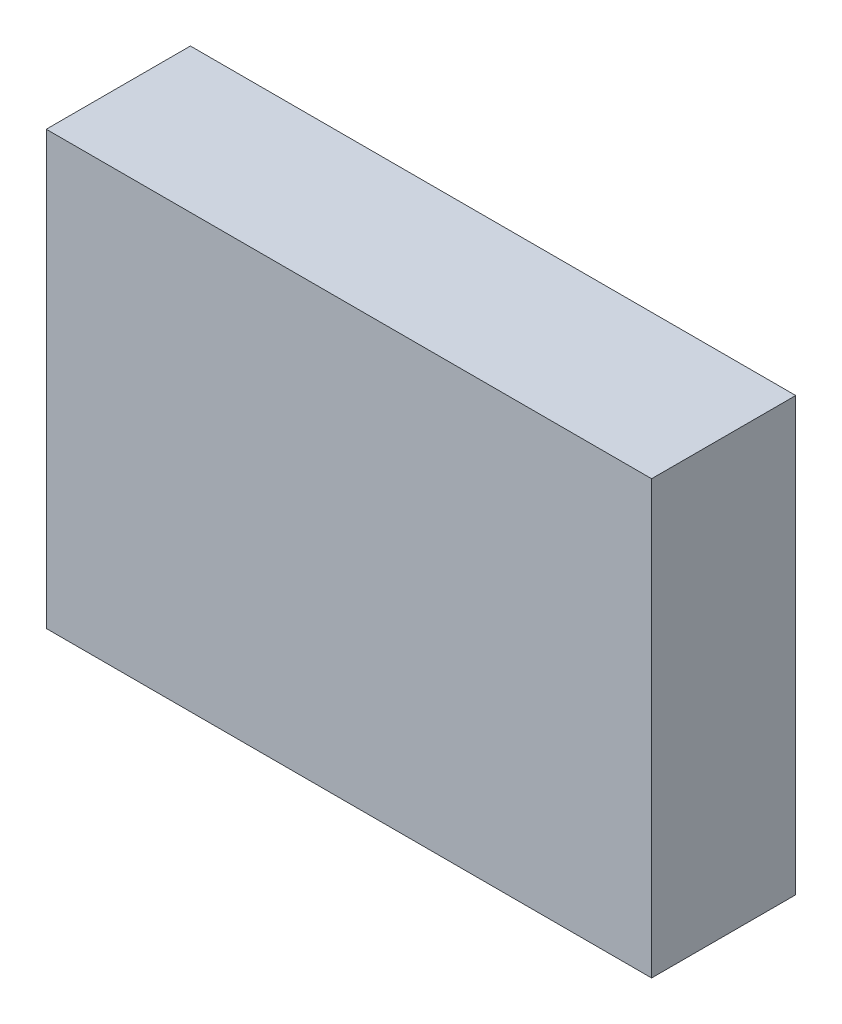
ISO-10303-21;
HEADER;
FILE_DESCRIPTION(('STEP AP214'),'2;1');
FILE_NAME('part.step','',(''),(''),'','','');
FILE_SCHEMA(('AUTOMOTIVE_DESIGN { 1 0 10303 214 1 1 1 1 }'));
ENDSEC;
DATA;
#1=APPLICATION_CONTEXT('core data for automotive mechanical design processes');
#2=APPLICATION_PROTOCOL_DEFINITION('international standard','automotive_design',2000,#1);
#3=PRODUCT_CONTEXT('',#1,'mechanical');
#4=PRODUCT('Part','Part','',(#3));
#5=PRODUCT_RELATED_PRODUCT_CATEGORY('part','',(#4));
#6=PRODUCT_DEFINITION_FORMATION('','',#4);
#7=PRODUCT_DEFINITION_CONTEXT('part definition',#1,'design');
#8=PRODUCT_DEFINITION('design','',#6,#7);
#9=PRODUCT_DEFINITION_SHAPE('','',#8);
#10=(LENGTH_UNIT() NAMED_UNIT(*) SI_UNIT(.MILLI.,.METRE.));
#11=(NAMED_UNIT(*) PLANE_ANGLE_UNIT() SI_UNIT($,.RADIAN.));
#12=(NAMED_UNIT(*) SI_UNIT($,.STERADIAN.) SOLID_ANGLE_UNIT());
#13=UNCERTAINTY_MEASURE_WITH_UNIT(LENGTH_MEASURE(1.E-05),#10,'distance_accuracy_value','');
#14=(GEOMETRIC_REPRESENTATION_CONTEXT(3) GLOBAL_UNCERTAINTY_ASSIGNED_CONTEXT((#13)) GLOBAL_UNIT_ASSIGNED_CONTEXT((#10,
#11,#12)) REPRESENTATION_CONTEXT('',''));
#15=CARTESIAN_POINT('',(0.,0.,0.));
#16=DIRECTION('',(0.,0.,1.));
#17=DIRECTION('',(1.,0.,0.));
#18=AXIS2_PLACEMENT_3D('',#15,#16,#17);
#19=CARTESIAN_POINT('',(-34.7640000999218,35.1704504784839,20.));
#20=DIRECTION('',(1.,0.,0.));
#21=DIRECTION('',(0.,1.,0.));
#22=AXIS2_PLACEMENT_3D('',#19,#20,#21);
#23=PLANE('',#22);
#24=DIRECTION('',(0.,-1.,0.));
#25=VECTOR('',#24,1.);
#26=CARTESIAN_POINT('',(-34.7640000999218,35.1704504784839,0.));
#27=LINE('',#26,#25);
#28=CARTESIAN_POINT('',(-34.7640000999218,35.1704504784839,0.));
#29=VERTEX_POINT('',#28);
#30=CARTESIAN_POINT('',(-34.7640000999218,-24.8295495215161,0.));
#31=VERTEX_POINT('',#30);
#32=EDGE_CURVE('E96',#29,#31,#27,.T.);
#33=ORIENTED_EDGE('',*,*,#32,.T.);
#34=DIRECTION('',(0.,0.,-1.));
#35=VECTOR('',#34,1.);
#36=CARTESIAN_POINT('',(-34.7640000999218,-24.8295495215161,20.));
#37=LINE('',#36,#35);
#38=CARTESIAN_POINT('',(-34.7640000999218,-24.8295495215161,20.));
#39=VERTEX_POINT('',#38);
#40=EDGE_CURVE('E11',#39,#31,#37,.T.);
#41=ORIENTED_EDGE('',*,*,#40,.F.);
#42=DIRECTION('',(0.,-1.,0.));
#43=VECTOR('',#42,1.);
#44=CARTESIAN_POINT('',(-34.7640000999218,35.1704504784839,20.));
#45=LINE('',#44,#43);
#46=CARTESIAN_POINT('',(-34.7640000999218,35.1704504784839,20.));
#47=VERTEX_POINT('',#46);
#48=EDGE_CURVE('E84',#47,#39,#45,.T.);
#49=ORIENTED_EDGE('',*,*,#48,.F.);
#50=DIRECTION('',(0.,0.,-1.));
#51=VECTOR('',#50,1.);
#52=CARTESIAN_POINT('',(-34.7640000999218,35.1704504784839,20.));
#53=LINE('',#52,#51);
#54=EDGE_CURVE('E92',#47,#29,#53,.T.);
#55=ORIENTED_EDGE('',*,*,#54,.T.);
#56=EDGE_LOOP('',(#33,#41,#49,#55));
#57=FACE_BOUND('',#56,.T.);
#58=ADVANCED_FACE('F33',(#57),#23,.F.);
#59=CARTESIAN_POINT('',(-34.7640000999218,-24.8295495215161,20.));
#60=DIRECTION('',(0.,1.,0.));
#61=DIRECTION('',(0.,0.,1.));
#62=AXIS2_PLACEMENT_3D('',#59,#60,#61);
#63=PLANE('',#62);
#64=DIRECTION('',(1.,0.,0.));
#65=VECTOR('',#64,1.);
#66=CARTESIAN_POINT('',(-34.7640000999218,-24.8295495215161,0.));
#67=LINE('',#66,#65);
#68=CARTESIAN_POINT('',(49.2359999000782,-24.8295495215161,0.));
#69=VERTEX_POINT('',#68);
#70=EDGE_CURVE('E88',#31,#69,#67,.T.);
#71=ORIENTED_EDGE('',*,*,#70,.T.);
#72=DIRECTION('',(0.,0.,-1.));
#73=VECTOR('',#72,1.);
#74=CARTESIAN_POINT('',(49.2359999000782,-24.8295495215161,20.));
#75=LINE('',#74,#73);
#76=CARTESIAN_POINT('',(49.2359999000782,-24.8295495215161,20.));
#77=VERTEX_POINT('',#76);
#78=EDGE_CURVE('E41',#77,#69,#75,.T.);
#79=ORIENTED_EDGE('',*,*,#78,.F.);
#80=DIRECTION('',(1.,0.,0.));
#81=VECTOR('',#80,1.);
#82=CARTESIAN_POINT('',(-34.7640000999218,-24.8295495215161,20.));
#83=LINE('',#82,#81);
#84=EDGE_CURVE('E79',#39,#77,#83,.T.);
#85=ORIENTED_EDGE('',*,*,#84,.F.);
#86=ORIENTED_EDGE('',*,*,#40,.T.);
#87=EDGE_LOOP('',(#71,#79,#85,#86));
#88=FACE_BOUND('',#87,.T.);
#89=ADVANCED_FACE('F87',(#88),#63,.F.);
#90=CARTESIAN_POINT('',(49.2359999000782,35.1704504784839,20.));
#91=DIRECTION('',(-1.,0.,0.));
#92=DIRECTION('',(0.,0.,1.));
#93=AXIS2_PLACEMENT_3D('',#90,#91,#92);
#94=PLANE('',#93);
#95=DIRECTION('',(0.,1.,0.));
#96=VECTOR('',#95,1.);
#97=CARTESIAN_POINT('',(49.2359999000782,35.1704504784839,0.));
#98=LINE('',#97,#96);
#99=CARTESIAN_POINT('',(49.2359999000782,35.1704504784839,0.));
#100=VERTEX_POINT('',#99);
#101=EDGE_CURVE('E66',#69,#100,#98,.T.);
#102=ORIENTED_EDGE('',*,*,#101,.T.);
#103=DIRECTION('',(0.,0.,-1.));
#104=VECTOR('',#103,1.);
#105=CARTESIAN_POINT('',(49.2359999000782,35.1704504784839,20.));
#106=LINE('',#105,#104);
#107=CARTESIAN_POINT('',(49.2359999000782,35.1704504784839,20.));
#108=VERTEX_POINT('',#107);
#109=EDGE_CURVE('E89',#108,#100,#106,.T.);
#110=ORIENTED_EDGE('',*,*,#109,.F.);
#111=DIRECTION('',(0.,1.,0.));
#112=VECTOR('',#111,1.);
#113=CARTESIAN_POINT('',(49.2359999000782,35.1704504784839,20.));
#114=LINE('',#113,#112);
#115=EDGE_CURVE('E82',#77,#108,#114,.T.);
#116=ORIENTED_EDGE('',*,*,#115,.F.);
#117=ORIENTED_EDGE('',*,*,#78,.T.);
#118=EDGE_LOOP('',(#102,#110,#116,#117));
#119=FACE_BOUND('',#118,.T.);
#120=ADVANCED_FACE('F90',(#119),#94,.F.);
#121=CARTESIAN_POINT('',(-34.7640000999218,35.1704504784839,20.));
#122=DIRECTION('',(0.,-1.,0.));
#123=DIRECTION('',(0.,0.,-1.));
#124=AXIS2_PLACEMENT_3D('',#121,#122,#123);
#125=PLANE('',#124);
#126=DIRECTION('',(-1.,0.,0.));
#127=VECTOR('',#126,1.);
#128=CARTESIAN_POINT('',(-34.7640000999218,35.1704504784839,0.));
#129=LINE('',#128,#127);
#130=EDGE_CURVE('E72',#100,#29,#129,.T.);
#131=ORIENTED_EDGE('',*,*,#130,.T.);
#132=ORIENTED_EDGE('',*,*,#54,.F.);
#133=DIRECTION('',(-1.,0.,0.));
#134=VECTOR('',#133,1.);
#135=CARTESIAN_POINT('',(-34.7640000999218,35.1704504784839,20.));
#136=LINE('',#135,#134);
#137=EDGE_CURVE('E49',#108,#47,#136,.T.);
#138=ORIENTED_EDGE('',*,*,#137,.F.);
#139=ORIENTED_EDGE('',*,*,#109,.T.);
#140=EDGE_LOOP('',(#131,#132,#138,#139));
#141=FACE_BOUND('',#140,.T.);
#142=ADVANCED_FACE('F103',(#141),#125,.F.);
#143=CARTESIAN_POINT('',(0.,0.,20.));
#144=DIRECTION('',(0.,0.,1.));
#145=DIRECTION('',(1.,0.,0.));
#146=AXIS2_PLACEMENT_3D('',#143,#144,#145);
#147=PLANE('',#146);
#148=ORIENTED_EDGE('',*,*,#48,.T.);
#149=ORIENTED_EDGE('',*,*,#84,.T.);
#150=ORIENTED_EDGE('',*,*,#115,.T.);
#151=ORIENTED_EDGE('',*,*,#137,.T.);
#152=EDGE_LOOP('',(#148,#149,#150,#151));
#153=FACE_BOUND('',#152,.T.);
#154=ADVANCED_FACE('F80',(#153),#147,.T.);
#155=CARTESIAN_POINT('',(0.,0.,0.));
#156=DIRECTION('',(0.,0.,1.));
#157=DIRECTION('',(1.,0.,0.));
#158=AXIS2_PLACEMENT_3D('',#155,#156,#157);
#159=PLANE('',#158);
#160=ORIENTED_EDGE('',*,*,#32,.F.);
#161=ORIENTED_EDGE('',*,*,#130,.F.);
#162=ORIENTED_EDGE('',*,*,#101,.F.);
#163=ORIENTED_EDGE('',*,*,#70,.F.);
#164=EDGE_LOOP('',(#160,#161,#162,#163));
#165=FACE_BOUND('',#164,.T.);
#166=ADVANCED_FACE('F106',(#165),#159,.F.);
#167=CLOSED_SHELL('',(#58,#89,#120,#142,#154,#166));
#168=MANIFOLD_SOLID_BREP('B2',#167);
#169=ADVANCED_BREP_SHAPE_REPRESENTATION('',(#18,#168),#14);
#170=SHAPE_DEFINITION_REPRESENTATION(#9,#169);
ENDSEC;
END-ISO-10303-21;
